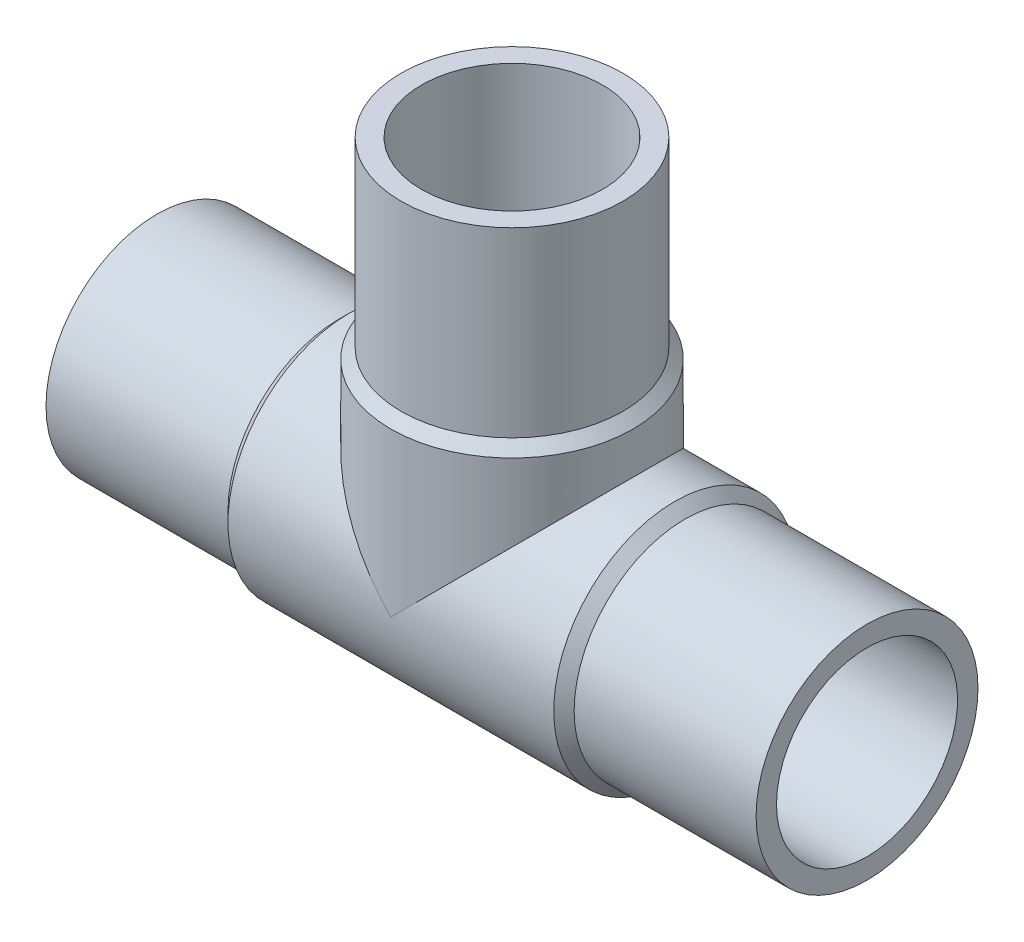
ISO-10303-21;
HEADER;
FILE_DESCRIPTION(('STEP AP214'),'2;1');
FILE_NAME('part.step','',(''),(''),'','','');
FILE_SCHEMA(('AUTOMOTIVE_DESIGN { 1 0 10303 214 1 1 1 1 }'));
ENDSEC;
DATA;
#1=APPLICATION_CONTEXT('core data for automotive mechanical design processes');
#2=APPLICATION_PROTOCOL_DEFINITION('international standard','automotive_design',2000,#1);
#3=PRODUCT_CONTEXT('',#1,'mechanical');
#4=PRODUCT('Part','Part','',(#3));
#5=PRODUCT_RELATED_PRODUCT_CATEGORY('part','',(#4));
#6=PRODUCT_DEFINITION_FORMATION('','',#4);
#7=PRODUCT_DEFINITION_CONTEXT('part definition',#1,'design');
#8=PRODUCT_DEFINITION('design','',#6,#7);
#9=PRODUCT_DEFINITION_SHAPE('','',#8);
#10=(LENGTH_UNIT() NAMED_UNIT(*) SI_UNIT(.MILLI.,.METRE.));
#11=(NAMED_UNIT(*) PLANE_ANGLE_UNIT() SI_UNIT($,.RADIAN.));
#12=(NAMED_UNIT(*) SI_UNIT($,.STERADIAN.) SOLID_ANGLE_UNIT());
#13=UNCERTAINTY_MEASURE_WITH_UNIT(LENGTH_MEASURE(1.E-05),#10,'distance_accuracy_value','');
#14=(GEOMETRIC_REPRESENTATION_CONTEXT(3) GLOBAL_UNCERTAINTY_ASSIGNED_CONTEXT((#13)) GLOBAL_UNIT_ASSIGNED_CONTEXT((#10,
#11,#12)) REPRESENTATION_CONTEXT('',''));
#15=CARTESIAN_POINT('',(0.,0.,0.));
#16=DIRECTION('',(0.,0.,1.));
#17=DIRECTION('',(1.,0.,0.));
#18=AXIS2_PLACEMENT_3D('',#15,#16,#17);
#19=CARTESIAN_POINT('',(-40.,40.,0.));
#20=DIRECTION('',(0.,1.,0.));
#21=DIRECTION('',(0.,0.,1.));
#22=AXIS2_PLACEMENT_3D('',#19,#20,#21);
#23=CYLINDRICAL_SURFACE('',#22,12.5);
#24=CARTESIAN_POINT('',(-40.,40.,0.));
#25=DIRECTION('',(0.,1.,0.));
#26=DIRECTION('',(0.,0.,1.));
#27=AXIS2_PLACEMENT_3D('',#24,#25,#26);
#28=CIRCLE('',#27,12.5);
#29=CARTESIAN_POINT('',(-40.,40.,12.5));
#30=VERTEX_POINT('',#29);
#31=EDGE_CURVE('E18',#30,#30,#28,.T.);
#32=ORIENTED_EDGE('',*,*,#31,.F.);
#33=EDGE_LOOP('',(#32));
#34=FACE_BOUND('',#33,.T.);
#35=CARTESIAN_POINT('',(-40.,19.5,0.));
#36=DIRECTION('',(0.,1.,0.));
#37=DIRECTION('',(1.,0.,0.));
#38=AXIS2_PLACEMENT_3D('',#35,#36,#37);
#39=CIRCLE('',#38,12.5);
#40=CARTESIAN_POINT('',(-27.5,19.5,0.));
#41=VERTEX_POINT('',#40);
#42=EDGE_CURVE('E71',#41,#41,#39,.F.);
#43=ORIENTED_EDGE('',*,*,#42,.F.);
#44=EDGE_LOOP('',(#43));
#45=FACE_BOUND('',#44,.T.);
#46=ADVANCED_FACE('F15',(#34,#45),#23,.T.);
#47=CARTESIAN_POINT('',(-40.,19.5,0.));
#48=DIRECTION('',(0.,-1.,0.));
#49=DIRECTION('',(0.,0.,-1.));
#50=AXIS2_PLACEMENT_3D('',#47,#48,#49);
#51=CONICAL_SURFACE('',#50,12.5,0.785398163397438);
#52=CARTESIAN_POINT('',(-40.,18.35,0.));
#53=DIRECTION('',(0.,1.,0.));
#54=DIRECTION('',(1.,0.,0.));
#55=AXIS2_PLACEMENT_3D('',#52,#53,#54);
#56=CIRCLE('',#55,13.65);
#57=CARTESIAN_POINT('',(-26.35,18.35,0.));
#58=VERTEX_POINT('',#57);
#59=EDGE_CURVE('E60',#58,#58,#56,.F.);
#60=ORIENTED_EDGE('',*,*,#59,.F.);
#61=EDGE_LOOP('',(#60));
#62=FACE_BOUND('',#61,.T.);
#63=ORIENTED_EDGE('',*,*,#42,.T.);
#64=EDGE_LOOP('',(#63));
#65=FACE_BOUND('',#64,.T.);
#66=ADVANCED_FACE('F141',(#62,#65),#51,.T.);
#67=CARTESIAN_POINT('',(-20.5,0.,0.));
#68=DIRECTION('',(-1.,0.,0.));
#69=DIRECTION('',(0.,0.,1.));
#70=AXIS2_PLACEMENT_3D('',#67,#68,#69);
#71=CYLINDRICAL_SURFACE('',#70,12.5);
#72=CARTESIAN_POINT('',(-20.5,0.,0.));
#73=DIRECTION('',(1.,0.,0.));
#74=DIRECTION('',(0.,1.,0.));
#75=AXIS2_PLACEMENT_3D('',#72,#73,#74);
#76=CIRCLE('',#75,12.5);
#77=CARTESIAN_POINT('',(-20.5,12.5,0.));
#78=VERTEX_POINT('',#77);
#79=EDGE_CURVE('E64',#78,#78,#76,.F.);
#80=ORIENTED_EDGE('',*,*,#79,.F.);
#81=EDGE_LOOP('',(#80));
#82=FACE_BOUND('',#81,.T.);
#83=CARTESIAN_POINT('',(0.,0.,0.));
#84=DIRECTION('',(-1.,0.,0.));
#85=DIRECTION('',(0.,0.,1.));
#86=AXIS2_PLACEMENT_3D('',#83,#84,#85);
#87=CIRCLE('',#86,12.5);
#88=CARTESIAN_POINT('',(0.,0.,12.5));
#89=VERTEX_POINT('',#88);
#90=EDGE_CURVE('E58',#89,#89,#87,.F.);
#91=ORIENTED_EDGE('',*,*,#90,.F.);
#92=EDGE_LOOP('',(#91));
#93=FACE_BOUND('',#92,.T.);
#94=ADVANCED_FACE('F136',(#82,#93),#71,.T.);
#95=CARTESIAN_POINT('',(-52.5,40.,12.6500021083112));
#96=DIRECTION('',(0.,1.,0.));
#97=DIRECTION('',(1.,0.,0.));
#98=AXIS2_PLACEMENT_3D('',#95,#96,#97);
#99=PLANE('',#98);
#100=CARTESIAN_POINT('',(-40.,40.,0.));
#101=DIRECTION('',(0.,1.,0.));
#102=DIRECTION('',(0.,0.,1.));
#103=AXIS2_PLACEMENT_3D('',#100,#101,#102);
#104=CIRCLE('',#103,10.2);
#105=CARTESIAN_POINT('',(-40.,40.,10.2));
#106=VERTEX_POINT('',#105);
#107=EDGE_CURVE('E52',#106,#106,#104,.T.);
#108=ORIENTED_EDGE('',*,*,#107,.F.);
#109=EDGE_LOOP('',(#108));
#110=FACE_BOUND('',#109,.T.);
#111=ORIENTED_EDGE('',*,*,#31,.T.);
#112=EDGE_LOOP('',(#111));
#113=FACE_BOUND('',#112,.T.);
#114=ADVANCED_FACE('F130',(#110,#113),#99,.T.);
#115=CARTESIAN_POINT('',(-20.5,0.,0.));
#116=DIRECTION('',(-1.,0.,0.));
#117=DIRECTION('',(0.,0.,1.));
#118=AXIS2_PLACEMENT_3D('',#115,#116,#117);
#119=CONICAL_SURFACE('',#118,12.5,0.785398163397437);
#120=ORIENTED_EDGE('',*,*,#79,.T.);
#121=EDGE_LOOP('',(#120));
#122=FACE_BOUND('',#121,.T.);
#123=CARTESIAN_POINT('',(-21.65,0.,0.));
#124=DIRECTION('',(-1.,0.,0.));
#125=DIRECTION('',(0.,1.,0.));
#126=AXIS2_PLACEMENT_3D('',#123,#124,#125);
#127=CIRCLE('',#126,13.65);
#128=CARTESIAN_POINT('',(-21.65,13.65,0.));
#129=VERTEX_POINT('',#128);
#130=EDGE_CURVE('E49',#129,#129,#127,.T.);
#131=ORIENTED_EDGE('',*,*,#130,.F.);
#132=EDGE_LOOP('',(#131));
#133=FACE_BOUND('',#132,.T.);
#134=ADVANCED_FACE('F95',(#122,#133),#119,.T.);
#135=CARTESIAN_POINT('',(-40.,18.35,0.));
#136=DIRECTION('',(0.,1.,0.));
#137=DIRECTION('',(0.,0.,1.));
#138=AXIS2_PLACEMENT_3D('',#135,#136,#137);
#139=CYLINDRICAL_SURFACE('',#138,13.65);
#140=CARTESIAN_POINT('',(-40.,0.,0.));
#141=DIRECTION('',(0.707106781186547,0.707106781186547,0.));
#142=DIRECTION('',(-0.707106781186547,0.707106781186547,0.));
#143=AXIS2_PLACEMENT_3D('',#140,#141,#142);
#144=ELLIPSE('',#143,19.3040151263927,13.65);
#145=CARTESIAN_POINT('',(-40.,0.,13.65));
#146=VERTEX_POINT('',#145);
#147=CARTESIAN_POINT('',(-40.,0.,-13.65));
#148=VERTEX_POINT('',#147);
#149=EDGE_CURVE('E44',#146,#148,#144,.F.);
#150=ORIENTED_EDGE('',*,*,#149,.F.);
#151=CARTESIAN_POINT('',(-40.,0.,0.));
#152=DIRECTION('',(-0.707106781186547,0.707106781186547,0.));
#153=DIRECTION('',(0.707106781186547,0.707106781186547,0.));
#154=AXIS2_PLACEMENT_3D('',#151,#152,#153);
#155=ELLIPSE('',#154,19.3040151263927,13.65);
#156=EDGE_CURVE('E40',#148,#146,#155,.F.);
#157=ORIENTED_EDGE('',*,*,#156,.F.);
#158=EDGE_LOOP('',(#150,#157));
#159=FACE_BOUND('',#158,.T.);
#160=ORIENTED_EDGE('',*,*,#59,.T.);
#161=EDGE_LOOP('',(#160));
#162=FACE_BOUND('',#161,.T.);
#163=ADVANCED_FACE('F47',(#159,#162),#139,.T.);
#164=CARTESIAN_POINT('',(0.,12.5,12.6500021083112));
#165=DIRECTION('',(1.,0.,0.));
#166=DIRECTION('',(0.,-1.,0.));
#167=AXIS2_PLACEMENT_3D('',#164,#165,#166);
#168=PLANE('',#167);
#169=CARTESIAN_POINT('',(0.,0.,0.));
#170=DIRECTION('',(-1.,0.,0.));
#171=DIRECTION('',(0.,0.,1.));
#172=AXIS2_PLACEMENT_3D('',#169,#170,#171);
#173=CIRCLE('',#172,10.2);
#174=CARTESIAN_POINT('',(0.,0.,10.2));
#175=VERTEX_POINT('',#174);
#176=EDGE_CURVE('E45',#175,#175,#173,.F.);
#177=ORIENTED_EDGE('',*,*,#176,.F.);
#178=EDGE_LOOP('',(#177));
#179=FACE_BOUND('',#178,.T.);
#180=ORIENTED_EDGE('',*,*,#90,.T.);
#181=EDGE_LOOP('',(#180));
#182=FACE_BOUND('',#181,.T.);
#183=ADVANCED_FACE('F85',(#179,#182),#168,.T.);
#184=CARTESIAN_POINT('',(-40.,0.,0.));
#185=DIRECTION('',(0.,1.,0.));
#186=DIRECTION('',(0.,0.,1.));
#187=AXIS2_PLACEMENT_3D('',#184,#185,#186);
#188=CYLINDRICAL_SURFACE('',#187,10.2);
#189=CARTESIAN_POINT('',(-40.,0.,0.));
#190=DIRECTION('',(-0.707106781186547,-0.707106781186548,0.));
#191=DIRECTION('',(-0.707106781186548,0.707106781186547,0.));
#192=AXIS2_PLACEMENT_3D('',#189,#190,#191);
#193=ELLIPSE('',#192,14.4249783362056,10.2);
#194=CARTESIAN_POINT('',(-40.,0.,-10.2));
#195=VERTEX_POINT('',#194);
#196=CARTESIAN_POINT('',(-40.,0.,10.2));
#197=VERTEX_POINT('',#196);
#198=EDGE_CURVE('E78',#195,#197,#193,.F.);
#199=ORIENTED_EDGE('',*,*,#198,.F.);
#200=CARTESIAN_POINT('',(-40.,0.,0.));
#201=DIRECTION('',(-0.707106781186547,0.707106781186547,0.));
#202=DIRECTION('',(0.707106781186547,0.707106781186547,0.));
#203=AXIS2_PLACEMENT_3D('',#200,#201,#202);
#204=ELLIPSE('',#203,14.4249783362056,10.2);
#205=EDGE_CURVE('E32',#195,#197,#204,.F.);
#206=ORIENTED_EDGE('',*,*,#205,.T.);
#207=EDGE_LOOP('',(#199,#206));
#208=FACE_BOUND('',#207,.T.);
#209=ORIENTED_EDGE('',*,*,#107,.T.);
#210=EDGE_LOOP('',(#209));
#211=FACE_BOUND('',#210,.T.);
#212=ADVANCED_FACE('F87',(#208,#211),#188,.F.);
#213=CARTESIAN_POINT('',(-58.35,0.,0.));
#214=DIRECTION('',(-1.,0.,0.));
#215=DIRECTION('',(0.,0.,1.));
#216=AXIS2_PLACEMENT_3D('',#213,#214,#215);
#217=CYLINDRICAL_SURFACE('',#216,13.65);
#218=ORIENTED_EDGE('',*,*,#130,.T.);
#219=EDGE_LOOP('',(#218));
#220=FACE_BOUND('',#219,.T.);
#221=CARTESIAN_POINT('',(-58.35,0.,0.));
#222=DIRECTION('',(-1.,0.,0.));
#223=DIRECTION('',(0.,1.,0.));
#224=AXIS2_PLACEMENT_3D('',#221,#222,#223);
#225=CIRCLE('',#224,13.65);
#226=CARTESIAN_POINT('',(-58.35,13.65,0.));
#227=VERTEX_POINT('',#226);
#228=EDGE_CURVE('E77',#227,#227,#225,.T.);
#229=ORIENTED_EDGE('',*,*,#228,.F.);
#230=EDGE_LOOP('',(#229));
#231=FACE_BOUND('',#230,.T.);
#232=ORIENTED_EDGE('',*,*,#149,.T.);
#233=ORIENTED_EDGE('',*,*,#156,.T.);
#234=EDGE_LOOP('',(#232,#233));
#235=FACE_BOUND('',#234,.T.);
#236=ADVANCED_FACE('F43',(#220,#231,#235),#217,.T.);
#237=CARTESIAN_POINT('',(-40.,0.,0.));
#238=DIRECTION('',(-1.,0.,0.));
#239=DIRECTION('',(0.,-1.,0.));
#240=AXIS2_PLACEMENT_3D('',#237,#238,#239);
#241=CYLINDRICAL_SURFACE('',#240,10.2);
#242=ORIENTED_EDGE('',*,*,#205,.F.);
#243=ORIENTED_EDGE('',*,*,#198,.T.);
#244=EDGE_LOOP('',(#242,#243));
#245=FACE_BOUND('',#244,.T.);
#246=ORIENTED_EDGE('',*,*,#176,.T.);
#247=EDGE_LOOP('',(#246));
#248=FACE_BOUND('',#247,.T.);
#249=CARTESIAN_POINT('',(-80.,0.,0.));
#250=DIRECTION('',(-1.,0.,0.));
#251=DIRECTION('',(0.,-1.,0.));
#252=AXIS2_PLACEMENT_3D('',#249,#250,#251);
#253=CIRCLE('',#252,10.2);
#254=CARTESIAN_POINT('',(-80.,-10.2,0.));
#255=VERTEX_POINT('',#254);
#256=EDGE_CURVE('E74',#255,#255,#253,.F.);
#257=ORIENTED_EDGE('',*,*,#256,.F.);
#258=EDGE_LOOP('',(#257));
#259=FACE_BOUND('',#258,.T.);
#260=ADVANCED_FACE('F82',(#245,#248,#259),#241,.F.);
#261=CARTESIAN_POINT('',(-59.5,0.,0.));
#262=DIRECTION('',(1.,0.,0.));
#263=DIRECTION('',(0.,0.,-1.));
#264=AXIS2_PLACEMENT_3D('',#261,#262,#263);
#265=CONICAL_SURFACE('',#264,12.5,0.78539816339744);
#266=ORIENTED_EDGE('',*,*,#228,.T.);
#267=EDGE_LOOP('',(#266));
#268=FACE_BOUND('',#267,.T.);
#269=CARTESIAN_POINT('',(-59.5,0.,0.));
#270=DIRECTION('',(-1.,0.,0.));
#271=DIRECTION('',(0.,1.,0.));
#272=AXIS2_PLACEMENT_3D('',#269,#270,#271);
#273=CIRCLE('',#272,12.5);
#274=CARTESIAN_POINT('',(-59.5,12.5,0.));
#275=VERTEX_POINT('',#274);
#276=EDGE_CURVE('E24',#275,#275,#273,.T.);
#277=ORIENTED_EDGE('',*,*,#276,.F.);
#278=EDGE_LOOP('',(#277));
#279=FACE_BOUND('',#278,.T.);
#280=ADVANCED_FACE('F105',(#268,#279),#265,.T.);
#281=CARTESIAN_POINT('',(-80.,-12.5,12.6500021083521));
#282=DIRECTION('',(-1.,0.,0.));
#283=DIRECTION('',(0.,1.,0.));
#284=AXIS2_PLACEMENT_3D('',#281,#282,#283);
#285=PLANE('',#284);
#286=ORIENTED_EDGE('',*,*,#256,.T.);
#287=EDGE_LOOP('',(#286));
#288=FACE_BOUND('',#287,.T.);
#289=CARTESIAN_POINT('',(-80.,0.,0.));
#290=DIRECTION('',(-1.,0.,0.));
#291=DIRECTION('',(0.,0.,1.));
#292=AXIS2_PLACEMENT_3D('',#289,#290,#291);
#293=CIRCLE('',#292,12.5);
#294=CARTESIAN_POINT('',(-80.,0.,12.5));
#295=VERTEX_POINT('',#294);
#296=EDGE_CURVE('E9',#295,#295,#293,.F.);
#297=ORIENTED_EDGE('',*,*,#296,.F.);
#298=EDGE_LOOP('',(#297));
#299=FACE_BOUND('',#298,.T.);
#300=ADVANCED_FACE('F99',(#288,#299),#285,.T.);
#301=CARTESIAN_POINT('',(-80.,0.,0.));
#302=DIRECTION('',(-1.,0.,0.));
#303=DIRECTION('',(0.,0.,1.));
#304=AXIS2_PLACEMENT_3D('',#301,#302,#303);
#305=CYLINDRICAL_SURFACE('',#304,12.5);
#306=ORIENTED_EDGE('',*,*,#276,.T.);
#307=EDGE_LOOP('',(#306));
#308=FACE_BOUND('',#307,.T.);
#309=ORIENTED_EDGE('',*,*,#296,.T.);
#310=EDGE_LOOP('',(#309));
#311=FACE_BOUND('',#310,.T.);
#312=ADVANCED_FACE('F97',(#308,#311),#305,.T.);
#313=CLOSED_SHELL('',(#46,#66,#94,#114,#134,#163,#183,#212,#236,#260,#280,#300,#312));
#314=MANIFOLD_SOLID_BREP('B1',#313);
#315=ADVANCED_BREP_SHAPE_REPRESENTATION('',(#18,#314),#14);
#316=SHAPE_DEFINITION_REPRESENTATION(#9,#315);
ENDSEC;
END-ISO-10303-21;
